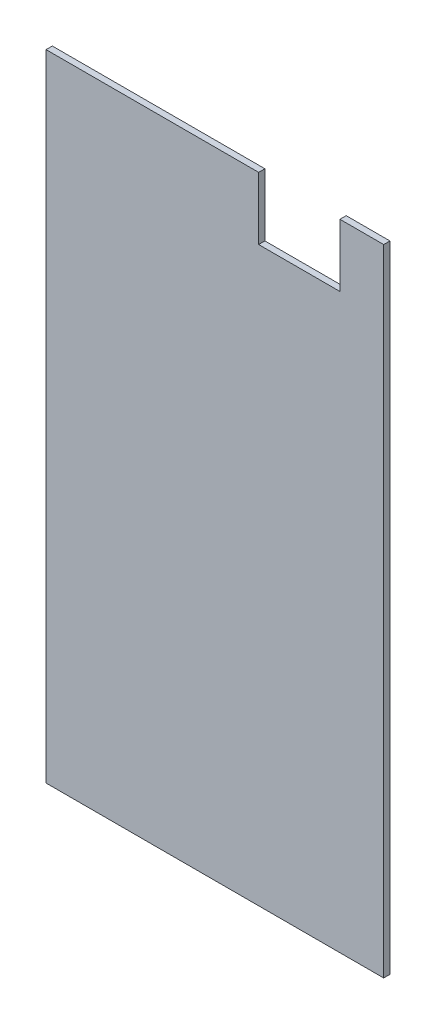
ISO-10303-21;
HEADER;
FILE_DESCRIPTION(('STEP AP214'),'2;1');
FILE_NAME('part.step','',(''),(''),'','','');
FILE_SCHEMA(('AUTOMOTIVE_DESIGN { 1 0 10303 214 1 1 1 1 }'));
ENDSEC;
DATA;
#1=APPLICATION_CONTEXT('core data for automotive mechanical design processes');
#2=APPLICATION_PROTOCOL_DEFINITION('international standard','automotive_design',2000,#1);
#3=PRODUCT_CONTEXT('',#1,'mechanical');
#4=PRODUCT('Part','Part','',(#3));
#5=PRODUCT_RELATED_PRODUCT_CATEGORY('part','',(#4));
#6=PRODUCT_DEFINITION_FORMATION('','',#4);
#7=PRODUCT_DEFINITION_CONTEXT('part definition',#1,'design');
#8=PRODUCT_DEFINITION('design','',#6,#7);
#9=PRODUCT_DEFINITION_SHAPE('','',#8);
#10=(LENGTH_UNIT() NAMED_UNIT(*) SI_UNIT(.MILLI.,.METRE.));
#11=(NAMED_UNIT(*) PLANE_ANGLE_UNIT() SI_UNIT($,.RADIAN.));
#12=(NAMED_UNIT(*) SI_UNIT($,.STERADIAN.) SOLID_ANGLE_UNIT());
#13=UNCERTAINTY_MEASURE_WITH_UNIT(LENGTH_MEASURE(1.E-05),#10,'distance_accuracy_value','');
#14=(GEOMETRIC_REPRESENTATION_CONTEXT(3) GLOBAL_UNCERTAINTY_ASSIGNED_CONTEXT((#13)) GLOBAL_UNIT_ASSIGNED_CONTEXT((#10,
#11,#12)) REPRESENTATION_CONTEXT('',''));
#15=CARTESIAN_POINT('',(0.,0.,0.));
#16=DIRECTION('',(0.,0.,1.));
#17=DIRECTION('',(1.,0.,0.));
#18=AXIS2_PLACEMENT_3D('',#15,#16,#17);
#19=CARTESIAN_POINT('',(-40.5,76.2,1.5));
#20=DIRECTION('',(0.,-1.,0.));
#21=DIRECTION('',(0.,0.,-1.));
#22=AXIS2_PLACEMENT_3D('',#19,#20,#21);
#23=PLANE('',#22);
#24=DIRECTION('',(0.,0.,1.));
#25=VECTOR('',#24,1.);
#26=CARTESIAN_POINT('',(10.5,76.2,-8.5));
#27=LINE('',#26,#25);
#28=CARTESIAN_POINT('',(10.5,76.2,0.));
#29=VERTEX_POINT('',#28);
#30=CARTESIAN_POINT('',(10.5,76.2,1.5));
#31=VERTEX_POINT('',#30);
#32=EDGE_CURVE('E122',#29,#31,#27,.T.);
#33=ORIENTED_EDGE('',*,*,#32,.F.);
#34=DIRECTION('',(-1.,0.,0.));
#35=VECTOR('',#34,1.);
#36=CARTESIAN_POINT('',(-40.5,76.2,0.));
#37=LINE('',#36,#35);
#38=CARTESIAN_POINT('',(-40.5,76.2,0.));
#39=VERTEX_POINT('',#38);
#40=EDGE_CURVE('E144',#29,#39,#37,.T.);
#41=ORIENTED_EDGE('',*,*,#40,.T.);
#42=DIRECTION('',(0.,0.,-1.));
#43=VECTOR('',#42,1.);
#44=CARTESIAN_POINT('',(-40.5,76.2,1.5));
#45=LINE('',#44,#43);
#46=CARTESIAN_POINT('',(-40.5,76.2,1.5));
#47=VERTEX_POINT('',#46);
#48=EDGE_CURVE('E154',#47,#39,#45,.T.);
#49=ORIENTED_EDGE('',*,*,#48,.F.);
#50=DIRECTION('',(-1.,0.,0.));
#51=VECTOR('',#50,1.);
#52=CARTESIAN_POINT('',(-40.5,76.2,1.5));
#53=LINE('',#52,#51);
#54=EDGE_CURVE('E136',#31,#47,#53,.T.);
#55=ORIENTED_EDGE('',*,*,#54,.F.);
#56=EDGE_LOOP('',(#33,#41,#49,#55));
#57=FACE_BOUND('',#56,.T.);
#58=ADVANCED_FACE('F33',(#57),#23,.F.);
#59=DIRECTION('',(0.,0.,1.));
#60=VECTOR('',#59,1.);
#61=CARTESIAN_POINT('',(30.,76.2,-8.5));
#62=LINE('',#61,#60);
#63=CARTESIAN_POINT('',(30.,76.2,0.));
#64=VERTEX_POINT('',#63);
#65=CARTESIAN_POINT('',(30.,76.2,1.5));
#66=VERTEX_POINT('',#65);
#67=EDGE_CURVE('E131',#64,#66,#62,.T.);
#68=ORIENTED_EDGE('',*,*,#67,.T.);
#69=CARTESIAN_POINT('',(40.5,76.2,1.5));
#70=VERTEX_POINT('',#69);
#71=EDGE_CURVE('E86',#70,#66,#53,.T.);
#72=ORIENTED_EDGE('',*,*,#71,.F.);
#73=DIRECTION('',(0.,0.,-1.));
#74=VECTOR('',#73,1.);
#75=CARTESIAN_POINT('',(40.5,76.2,1.5));
#76=LINE('',#75,#74);
#77=CARTESIAN_POINT('',(40.5,76.2,0.));
#78=VERTEX_POINT('',#77);
#79=EDGE_CURVE('E157',#70,#78,#76,.T.);
#80=ORIENTED_EDGE('',*,*,#79,.T.);
#81=EDGE_CURVE('E145',#78,#64,#37,.T.);
#82=ORIENTED_EDGE('',*,*,#81,.T.);
#83=EDGE_LOOP('',(#68,#72,#80,#82));
#84=FACE_BOUND('',#83,.T.);
#85=ADVANCED_FACE('F177',(#84),#23,.F.);
#86=CARTESIAN_POINT('',(0.,0.,1.5));
#87=DIRECTION('',(0.,0.,1.));
#88=DIRECTION('',(1.,0.,0.));
#89=AXIS2_PLACEMENT_3D('',#86,#87,#88);
#90=PLANE('',#89);
#91=DIRECTION('',(-1.,0.,0.));
#92=VECTOR('',#91,1.);
#93=CARTESIAN_POINT('',(0.,61.2,1.5));
#94=LINE('',#93,#92);
#95=CARTESIAN_POINT('',(30.,61.2,1.5));
#96=VERTEX_POINT('',#95);
#97=CARTESIAN_POINT('',(10.5,61.2,1.5));
#98=VERTEX_POINT('',#97);
#99=EDGE_CURVE('E110',#96,#98,#94,.T.);
#100=ORIENTED_EDGE('',*,*,#99,.T.);
#101=DIRECTION('',(0.,1.,0.));
#102=VECTOR('',#101,1.);
#103=CARTESIAN_POINT('',(10.5,0.,1.5));
#104=LINE('',#103,#102);
#105=EDGE_CURVE('E119',#98,#31,#104,.T.);
#106=ORIENTED_EDGE('',*,*,#105,.T.);
#107=ORIENTED_EDGE('',*,*,#54,.T.);
#108=DIRECTION('',(0.,-1.,0.));
#109=VECTOR('',#108,1.);
#110=CARTESIAN_POINT('',(-40.5,76.2,1.5));
#111=LINE('',#110,#109);
#112=CARTESIAN_POINT('',(-40.5,-76.2,1.5));
#113=VERTEX_POINT('',#112);
#114=EDGE_CURVE('E138',#47,#113,#111,.T.);
#115=ORIENTED_EDGE('',*,*,#114,.T.);
#116=DIRECTION('',(1.,0.,0.));
#117=VECTOR('',#116,1.);
#118=CARTESIAN_POINT('',(-40.5,-76.2,1.5));
#119=LINE('',#118,#117);
#120=CARTESIAN_POINT('',(40.5,-76.2,1.5));
#121=VERTEX_POINT('',#120);
#122=EDGE_CURVE('E57',#113,#121,#119,.T.);
#123=ORIENTED_EDGE('',*,*,#122,.T.);
#124=DIRECTION('',(0.,1.,0.));
#125=VECTOR('',#124,1.);
#126=CARTESIAN_POINT('',(40.5,76.2,1.5));
#127=LINE('',#126,#125);
#128=EDGE_CURVE('E134',#121,#70,#127,.T.);
#129=ORIENTED_EDGE('',*,*,#128,.T.);
#130=ORIENTED_EDGE('',*,*,#71,.T.);
#131=DIRECTION('',(0.,-1.,0.));
#132=VECTOR('',#131,1.);
#133=CARTESIAN_POINT('',(30.,0.,1.5));
#134=LINE('',#133,#132);
#135=EDGE_CURVE('E116',#66,#96,#134,.T.);
#136=ORIENTED_EDGE('',*,*,#135,.T.);
#137=EDGE_LOOP('',(#100,#106,#107,#115,#123,#129,#130,#136));
#138=FACE_BOUND('',#137,.T.);
#139=ADVANCED_FACE('F125',(#138),#90,.T.);
#140=CARTESIAN_POINT('',(0.,0.,0.));
#141=DIRECTION('',(0.,0.,1.));
#142=DIRECTION('',(1.,0.,0.));
#143=AXIS2_PLACEMENT_3D('',#140,#141,#142);
#144=PLANE('',#143);
#145=DIRECTION('',(0.,1.,0.));
#146=VECTOR('',#145,1.);
#147=CARTESIAN_POINT('',(10.5,0.,0.));
#148=LINE('',#147,#146);
#149=CARTESIAN_POINT('',(10.5,61.2,0.));
#150=VERTEX_POINT('',#149);
#151=EDGE_CURVE('E11',#150,#29,#148,.T.);
#152=ORIENTED_EDGE('',*,*,#151,.F.);
#153=DIRECTION('',(-1.,0.,0.));
#154=VECTOR('',#153,1.);
#155=CARTESIAN_POINT('',(0.,61.2,0.));
#156=LINE('',#155,#154);
#157=CARTESIAN_POINT('',(30.,61.2,0.));
#158=VERTEX_POINT('',#157);
#159=EDGE_CURVE('E113',#158,#150,#156,.T.);
#160=ORIENTED_EDGE('',*,*,#159,.F.);
#161=DIRECTION('',(0.,-1.,0.));
#162=VECTOR('',#161,1.);
#163=CARTESIAN_POINT('',(30.,0.,0.));
#164=LINE('',#163,#162);
#165=EDGE_CURVE('E41',#64,#158,#164,.T.);
#166=ORIENTED_EDGE('',*,*,#165,.F.);
#167=ORIENTED_EDGE('',*,*,#81,.F.);
#168=DIRECTION('',(0.,1.,0.));
#169=VECTOR('',#168,1.);
#170=CARTESIAN_POINT('',(40.5,76.2,0.));
#171=LINE('',#170,#169);
#172=CARTESIAN_POINT('',(40.5,-76.2,0.));
#173=VERTEX_POINT('',#172);
#174=EDGE_CURVE('E130',#173,#78,#171,.T.);
#175=ORIENTED_EDGE('',*,*,#174,.F.);
#176=DIRECTION('',(1.,0.,0.));
#177=VECTOR('',#176,1.);
#178=CARTESIAN_POINT('',(-40.5,-76.2,0.));
#179=LINE('',#178,#177);
#180=CARTESIAN_POINT('',(-40.5,-76.2,0.));
#181=VERTEX_POINT('',#180);
#182=EDGE_CURVE('E78',#181,#173,#179,.T.);
#183=ORIENTED_EDGE('',*,*,#182,.F.);
#184=DIRECTION('',(0.,-1.,0.));
#185=VECTOR('',#184,1.);
#186=CARTESIAN_POINT('',(-40.5,76.2,0.));
#187=LINE('',#186,#185);
#188=EDGE_CURVE('E148',#39,#181,#187,.T.);
#189=ORIENTED_EDGE('',*,*,#188,.F.);
#190=ORIENTED_EDGE('',*,*,#40,.F.);
#191=EDGE_LOOP('',(#152,#160,#166,#167,#175,#183,#189,#190));
#192=FACE_BOUND('',#191,.T.);
#193=ADVANCED_FACE('F163',(#192),#144,.F.);
#194=CARTESIAN_POINT('',(40.5,76.2,1.5));
#195=DIRECTION('',(-1.,0.,0.));
#196=DIRECTION('',(0.,-1.,0.));
#197=AXIS2_PLACEMENT_3D('',#194,#195,#196);
#198=PLANE('',#197);
#199=ORIENTED_EDGE('',*,*,#174,.T.);
#200=ORIENTED_EDGE('',*,*,#79,.F.);
#201=ORIENTED_EDGE('',*,*,#128,.F.);
#202=DIRECTION('',(0.,0.,-1.));
#203=VECTOR('',#202,1.);
#204=CARTESIAN_POINT('',(40.5,-76.2,1.5));
#205=LINE('',#204,#203);
#206=EDGE_CURVE('E141',#121,#173,#205,.T.);
#207=ORIENTED_EDGE('',*,*,#206,.T.);
#208=EDGE_LOOP('',(#199,#200,#201,#207));
#209=FACE_BOUND('',#208,.T.);
#210=ADVANCED_FACE('F35',(#209),#198,.F.);
#211=CARTESIAN_POINT('',(-40.5,76.2,1.5));
#212=DIRECTION('',(1.,0.,0.));
#213=DIRECTION('',(0.,1.,0.));
#214=AXIS2_PLACEMENT_3D('',#211,#212,#213);
#215=PLANE('',#214);
#216=ORIENTED_EDGE('',*,*,#188,.T.);
#217=DIRECTION('',(0.,0.,-1.));
#218=VECTOR('',#217,1.);
#219=CARTESIAN_POINT('',(-40.5,-76.2,1.5));
#220=LINE('',#219,#218);
#221=EDGE_CURVE('E152',#113,#181,#220,.T.);
#222=ORIENTED_EDGE('',*,*,#221,.F.);
#223=ORIENTED_EDGE('',*,*,#114,.F.);
#224=ORIENTED_EDGE('',*,*,#48,.T.);
#225=EDGE_LOOP('',(#216,#222,#223,#224));
#226=FACE_BOUND('',#225,.T.);
#227=ADVANCED_FACE('F171',(#226),#215,.F.);
#228=CARTESIAN_POINT('',(-40.5,-76.2,1.5));
#229=DIRECTION('',(0.,1.,0.));
#230=DIRECTION('',(0.,0.,1.));
#231=AXIS2_PLACEMENT_3D('',#228,#229,#230);
#232=PLANE('',#231);
#233=ORIENTED_EDGE('',*,*,#182,.T.);
#234=ORIENTED_EDGE('',*,*,#206,.F.);
#235=ORIENTED_EDGE('',*,*,#122,.F.);
#236=ORIENTED_EDGE('',*,*,#221,.T.);
#237=EDGE_LOOP('',(#233,#234,#235,#236));
#238=FACE_BOUND('',#237,.T.);
#239=ADVANCED_FACE('F172',(#238),#232,.F.);
#240=CARTESIAN_POINT('',(10.5,0.,-8.5));
#241=DIRECTION('',(1.,0.,0.));
#242=DIRECTION('',(0.,0.,-1.));
#243=AXIS2_PLACEMENT_3D('',#240,#241,#242);
#244=PLANE('',#243);
#245=ORIENTED_EDGE('',*,*,#151,.T.);
#246=ORIENTED_EDGE('',*,*,#32,.T.);
#247=ORIENTED_EDGE('',*,*,#105,.F.);
#248=DIRECTION('',(0.,0.,1.));
#249=VECTOR('',#248,1.);
#250=CARTESIAN_POINT('',(10.5,61.2,-8.5));
#251=LINE('',#250,#249);
#252=EDGE_CURVE('E106',#150,#98,#251,.T.);
#253=ORIENTED_EDGE('',*,*,#252,.F.);
#254=EDGE_LOOP('',(#245,#246,#247,#253));
#255=FACE_BOUND('',#254,.T.);
#256=ADVANCED_FACE('F120',(#255),#244,.T.);
#257=CARTESIAN_POINT('',(30.,0.,-8.5));
#258=DIRECTION('',(-1.,0.,0.));
#259=DIRECTION('',(0.,-1.,0.));
#260=AXIS2_PLACEMENT_3D('',#257,#258,#259);
#261=PLANE('',#260);
#262=ORIENTED_EDGE('',*,*,#165,.T.);
#263=DIRECTION('',(0.,0.,1.));
#264=VECTOR('',#263,1.);
#265=CARTESIAN_POINT('',(30.,61.2,-8.5));
#266=LINE('',#265,#264);
#267=EDGE_CURVE('E48',#158,#96,#266,.T.);
#268=ORIENTED_EDGE('',*,*,#267,.T.);
#269=ORIENTED_EDGE('',*,*,#135,.F.);
#270=ORIENTED_EDGE('',*,*,#67,.F.);
#271=EDGE_LOOP('',(#262,#268,#269,#270));
#272=FACE_BOUND('',#271,.T.);
#273=ADVANCED_FACE('F161',(#272),#261,.T.);
#274=CARTESIAN_POINT('',(0.,61.2,-8.5));
#275=DIRECTION('',(0.,1.,0.));
#276=DIRECTION('',(-1.,0.,0.));
#277=AXIS2_PLACEMENT_3D('',#274,#275,#276);
#278=PLANE('',#277);
#279=ORIENTED_EDGE('',*,*,#159,.T.);
#280=ORIENTED_EDGE('',*,*,#252,.T.);
#281=ORIENTED_EDGE('',*,*,#99,.F.);
#282=ORIENTED_EDGE('',*,*,#267,.F.);
#283=EDGE_LOOP('',(#279,#280,#281,#282));
#284=FACE_BOUND('',#283,.T.);
#285=ADVANCED_FACE('F108',(#284),#278,.T.);
#286=CLOSED_SHELL('',(#58,#85,#139,#193,#210,#227,#239,#256,#273,#285));
#287=MANIFOLD_SOLID_BREP('B2',#286);
#288=ADVANCED_BREP_SHAPE_REPRESENTATION('',(#18,#287),#14);
#289=SHAPE_DEFINITION_REPRESENTATION(#9,#288);
ENDSEC;
END-ISO-10303-21;
